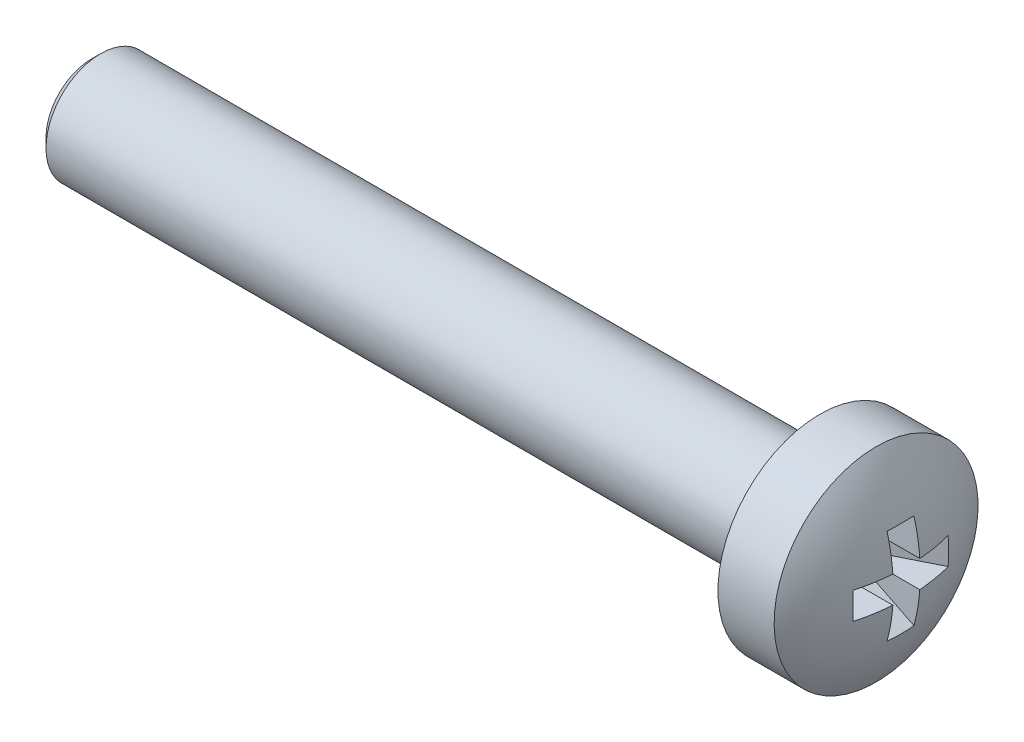
ISO-10303-21;
HEADER;
FILE_DESCRIPTION(('STEP AP214'),'2;1');
FILE_NAME('part.step','',(''),(''),'','','');
FILE_SCHEMA(('AUTOMOTIVE_DESIGN { 1 0 10303 214 1 1 1 1 }'));
ENDSEC;
DATA;
#1=APPLICATION_CONTEXT('core data for automotive mechanical design processes');
#2=APPLICATION_PROTOCOL_DEFINITION('international standard','automotive_design',2000,#1);
#3=PRODUCT_CONTEXT('',#1,'mechanical');
#4=PRODUCT('Part','Part','',(#3));
#5=PRODUCT_RELATED_PRODUCT_CATEGORY('part','',(#4));
#6=PRODUCT_DEFINITION_FORMATION('','',#4);
#7=PRODUCT_DEFINITION_CONTEXT('part definition',#1,'design');
#8=PRODUCT_DEFINITION('design','',#6,#7);
#9=PRODUCT_DEFINITION_SHAPE('','',#8);
#10=(LENGTH_UNIT() NAMED_UNIT(*) SI_UNIT(.MILLI.,.METRE.));
#11=(NAMED_UNIT(*) PLANE_ANGLE_UNIT() SI_UNIT($,.RADIAN.));
#12=(NAMED_UNIT(*) SI_UNIT($,.STERADIAN.) SOLID_ANGLE_UNIT());
#13=UNCERTAINTY_MEASURE_WITH_UNIT(LENGTH_MEASURE(1.E-05),#10,'distance_accuracy_value','');
#14=(GEOMETRIC_REPRESENTATION_CONTEXT(3) GLOBAL_UNCERTAINTY_ASSIGNED_CONTEXT((#13)) GLOBAL_UNIT_ASSIGNED_CONTEXT((#10,
#11,#12)) REPRESENTATION_CONTEXT('',''));
#15=CARTESIAN_POINT('',(0.,0.,0.));
#16=DIRECTION('',(0.,0.,1.));
#17=DIRECTION('',(1.,0.,0.));
#18=AXIS2_PLACEMENT_3D('',#15,#16,#17);
#19=CARTESIAN_POINT('',(-5.,0.,0.));
#20=DIRECTION('',(1.,0.,0.));
#21=DIRECTION('',(0.,-1.,0.));
#22=AXIS2_PLACEMENT_3D('',#19,#20,#21);
#23=SPHERICAL_SURFACE('',#22,5.);
#24=CARTESIAN_POINT('',(-4.56358241491322,0.,-0.875318258911803));
#25=DIRECTION('',(0.446197813109809,0.,-0.894934361602025));
#26=DIRECTION('',(-0.894934361602025,0.,-0.446197813109809));
#27=AXIS2_PLACEMENT_3D('',#24,#25,#26);
#28=CIRCLE('',#27,4.90340265907692);
#29=CARTESIAN_POINT('',(-0.187869730483241,0.37,1.3063316076711));
#30=VERTEX_POINT('',#29);
#31=CARTESIAN_POINT('',(-0.187869730483241,-0.37,1.3063316076711));
#32=VERTEX_POINT('',#31);
#33=EDGE_CURVE('E195',#30,#32,#28,.T.);
#34=ORIENTED_EDGE('',*,*,#33,.F.);
#35=CARTESIAN_POINT('',(-5.,0.37,0.));
#36=DIRECTION('',(0.,-1.,0.));
#37=DIRECTION('',(0.,0.,-1.));
#38=AXIS2_PLACEMENT_3D('',#35,#36,#37);
#39=CIRCLE('',#38,4.98629120689917);
#40=CARTESIAN_POINT('',(-0.0274553797879303,0.37,0.37));
#41=VERTEX_POINT('',#40);
#42=EDGE_CURVE('E114',#30,#41,#39,.F.);
#43=ORIENTED_EDGE('',*,*,#42,.T.);
#44=CARTESIAN_POINT('',(-5.,0.,0.37));
#45=DIRECTION('',(0.,0.,1.));
#46=DIRECTION('',(0.,-1.,0.));
#47=AXIS2_PLACEMENT_3D('',#44,#45,#46);
#48=CIRCLE('',#47,4.98629120689917);
#49=CARTESIAN_POINT('',(-0.187869730483241,1.3063316076711,0.37));
#50=VERTEX_POINT('',#49);
#51=EDGE_CURVE('E146',#50,#41,#48,.F.);
#52=ORIENTED_EDGE('',*,*,#51,.F.);
#53=CARTESIAN_POINT('',(-4.56358241491322,-0.875318258911803,0.));
#54=DIRECTION('',(0.446197813109809,-0.894934361602025,0.));
#55=DIRECTION('',(0.894934361602025,0.446197813109809,0.));
#56=AXIS2_PLACEMENT_3D('',#53,#54,#55);
#57=CIRCLE('',#56,4.90340265907692);
#58=CARTESIAN_POINT('',(-0.187869730483241,1.3063316076711,-0.37));
#59=VERTEX_POINT('',#58);
#60=EDGE_CURVE('E143',#50,#59,#57,.F.);
#61=ORIENTED_EDGE('',*,*,#60,.T.);
#62=CARTESIAN_POINT('',(-5.,0.,-0.37));
#63=DIRECTION('',(0.,0.,1.));
#64=DIRECTION('',(0.,-1.,0.));
#65=AXIS2_PLACEMENT_3D('',#62,#63,#64);
#66=CIRCLE('',#65,4.98629120689917);
#67=CARTESIAN_POINT('',(-0.0274553797879303,0.37,-0.37));
#68=VERTEX_POINT('',#67);
#69=EDGE_CURVE('E147',#59,#68,#66,.F.);
#70=ORIENTED_EDGE('',*,*,#69,.T.);
#71=CARTESIAN_POINT('',(-5.,0.37,0.));
#72=DIRECTION('',(0.,-1.,0.));
#73=DIRECTION('',(0.,0.,-1.));
#74=AXIS2_PLACEMENT_3D('',#71,#72,#73);
#75=CIRCLE('',#74,4.98629120689917);
#76=CARTESIAN_POINT('',(-0.187869730483241,0.37,-1.3063316076711));
#77=VERTEX_POINT('',#76);
#78=EDGE_CURVE('E197',#68,#77,#75,.F.);
#79=ORIENTED_EDGE('',*,*,#78,.T.);
#80=CARTESIAN_POINT('',(-4.56358241491322,0.,0.875318258911803));
#81=DIRECTION('',(0.446197813109809,0.,0.894934361602025));
#82=DIRECTION('',(0.894934361602025,0.,-0.446197813109809));
#83=AXIS2_PLACEMENT_3D('',#80,#81,#82);
#84=CIRCLE('',#83,4.90340265907692);
#85=CARTESIAN_POINT('',(-0.187869730483241,-0.37,-1.3063316076711));
#86=VERTEX_POINT('',#85);
#87=EDGE_CURVE('E200',#77,#86,#84,.F.);
#88=ORIENTED_EDGE('',*,*,#87,.T.);
#89=CARTESIAN_POINT('',(-5.,-0.37,0.));
#90=DIRECTION('',(0.,-1.,0.));
#91=DIRECTION('',(0.,0.,-1.));
#92=AXIS2_PLACEMENT_3D('',#89,#90,#91);
#93=CIRCLE('',#92,4.98629120689917);
#94=CARTESIAN_POINT('',(-0.0274553797879303,-0.37,-0.37));
#95=VERTEX_POINT('',#94);
#96=EDGE_CURVE('E201',#95,#86,#93,.F.);
#97=ORIENTED_EDGE('',*,*,#96,.F.);
#98=CARTESIAN_POINT('',(-5.,0.,-0.37));
#99=DIRECTION('',(0.,0.,1.));
#100=DIRECTION('',(0.,-1.,0.));
#101=AXIS2_PLACEMENT_3D('',#98,#99,#100);
#102=CIRCLE('',#101,4.98629120689917);
#103=CARTESIAN_POINT('',(-0.187869730483241,-1.3063316076711,-0.37));
#104=VERTEX_POINT('',#103);
#105=EDGE_CURVE('E157',#95,#104,#102,.F.);
#106=ORIENTED_EDGE('',*,*,#105,.T.);
#107=CARTESIAN_POINT('',(-4.56358241491322,0.875318258911802,0.));
#108=DIRECTION('',(0.446197813109809,0.894934361602025,0.));
#109=DIRECTION('',(-0.894934361602025,0.446197813109809,0.));
#110=AXIS2_PLACEMENT_3D('',#107,#108,#109);
#111=CIRCLE('',#110,4.90340265907692);
#112=CARTESIAN_POINT('',(-0.187869730483241,-1.3063316076711,0.37));
#113=VERTEX_POINT('',#112);
#114=EDGE_CURVE('E154',#113,#104,#111,.T.);
#115=ORIENTED_EDGE('',*,*,#114,.F.);
#116=CARTESIAN_POINT('',(-5.,0.,0.37));
#117=DIRECTION('',(0.,0.,1.));
#118=DIRECTION('',(0.,-1.,0.));
#119=AXIS2_PLACEMENT_3D('',#116,#117,#118);
#120=CIRCLE('',#119,4.98629120689917);
#121=CARTESIAN_POINT('',(-0.0274553797879303,-0.37,0.37));
#122=VERTEX_POINT('',#121);
#123=EDGE_CURVE('E158',#122,#113,#120,.F.);
#124=ORIENTED_EDGE('',*,*,#123,.F.);
#125=CARTESIAN_POINT('',(-5.,-0.37,0.));
#126=DIRECTION('',(0.,-1.,0.));
#127=DIRECTION('',(0.,0.,-1.));
#128=AXIS2_PLACEMENT_3D('',#125,#126,#127);
#129=CIRCLE('',#128,4.98629120689917);
#130=EDGE_CURVE('E193',#32,#122,#129,.F.);
#131=ORIENTED_EDGE('',*,*,#130,.F.);
#132=EDGE_LOOP('',(#34,#43,#52,#61,#70,#79,#88,#97,#106,#115,#124,#131));
#133=FACE_BOUND('',#132,.T.);
#134=CARTESIAN_POINT('',(-0.857536964558404,0.,0.));
#135=DIRECTION('',(1.,0.,0.));
#136=DIRECTION('',(0.,1.,0.));
#137=AXIS2_PLACEMENT_3D('',#134,#135,#136);
#138=CIRCLE('',#137,2.8);
#139=CARTESIAN_POINT('',(-0.857536964558404,2.8,0.));
#140=VERTEX_POINT('',#139);
#141=EDGE_CURVE('E118',#140,#140,#138,.T.);
#142=ORIENTED_EDGE('',*,*,#141,.T.);
#143=EDGE_LOOP('',(#142));
#144=FACE_BOUND('',#143,.T.);
#145=ADVANCED_FACE('F16',(#133,#144),#23,.T.);
#146=CARTESIAN_POINT('',(-22.4,0.,0.));
#147=DIRECTION('',(-1.,0.,0.));
#148=DIRECTION('',(0.,-1.,0.));
#149=AXIS2_PLACEMENT_3D('',#146,#147,#148);
#150=PLANE('',#149);
#151=CARTESIAN_POINT('',(-22.4,0.,0.));
#152=DIRECTION('',(-1.,0.,0.));
#153=DIRECTION('',(0.,-1.,0.));
#154=AXIS2_PLACEMENT_3D('',#151,#152,#153);
#155=CIRCLE('',#154,1.25);
#156=CARTESIAN_POINT('',(-22.4,-1.25,0.));
#157=VERTEX_POINT('',#156);
#158=EDGE_CURVE('E10',#157,#157,#155,.T.);
#159=ORIENTED_EDGE('',*,*,#158,.T.);
#160=EDGE_LOOP('',(#159));
#161=FACE_BOUND('',#160,.T.);
#162=ADVANCED_FACE('F262',(#161),#150,.T.);
#163=CARTESIAN_POINT('',(0.,0.,0.));
#164=DIRECTION('',(1.,0.,0.));
#165=DIRECTION('',(0.,1.,0.));
#166=AXIS2_PLACEMENT_3D('',#163,#164,#165);
#167=CYLINDRICAL_SURFACE('',#166,1.5);
#168=CARTESIAN_POINT('',(-22.15,0.,0.));
#169=DIRECTION('',(-1.,0.,0.));
#170=DIRECTION('',(0.,-1.,0.));
#171=AXIS2_PLACEMENT_3D('',#168,#169,#170);
#172=CIRCLE('',#171,1.5);
#173=CARTESIAN_POINT('',(-22.15,-1.5,0.));
#174=VERTEX_POINT('',#173);
#175=EDGE_CURVE('E26',#174,#174,#172,.F.);
#176=ORIENTED_EDGE('',*,*,#175,.T.);
#177=EDGE_LOOP('',(#176));
#178=FACE_BOUND('',#177,.T.);
#179=CARTESIAN_POINT('',(-2.4,0.,0.));
#180=DIRECTION('',(1.,0.,0.));
#181=DIRECTION('',(0.,1.,0.));
#182=AXIS2_PLACEMENT_3D('',#179,#180,#181);
#183=CIRCLE('',#182,1.5);
#184=CARTESIAN_POINT('',(-2.4,1.5,0.));
#185=VERTEX_POINT('',#184);
#186=EDGE_CURVE('E190',#185,#185,#183,.T.);
#187=ORIENTED_EDGE('',*,*,#186,.F.);
#188=EDGE_LOOP('',(#187));
#189=FACE_BOUND('',#188,.T.);
#190=ADVANCED_FACE('F268',(#178,#189),#167,.T.);
#191=CARTESIAN_POINT('',(-2.4,1.5,0.));
#192=DIRECTION('',(-1.,0.,0.));
#193=DIRECTION('',(0.,-1.,0.));
#194=AXIS2_PLACEMENT_3D('',#191,#192,#193);
#195=PLANE('',#194);
#196=ORIENTED_EDGE('',*,*,#186,.T.);
#197=EDGE_LOOP('',(#196));
#198=FACE_BOUND('',#197,.T.);
#199=CARTESIAN_POINT('',(-2.4,0.,0.));
#200=DIRECTION('',(1.,0.,0.));
#201=DIRECTION('',(0.,1.,0.));
#202=AXIS2_PLACEMENT_3D('',#199,#200,#201);
#203=CIRCLE('',#202,2.8);
#204=CARTESIAN_POINT('',(-2.4,2.8,0.));
#205=VERTEX_POINT('',#204);
#206=EDGE_CURVE('E187',#205,#205,#203,.T.);
#207=ORIENTED_EDGE('',*,*,#206,.F.);
#208=EDGE_LOOP('',(#207));
#209=FACE_BOUND('',#208,.T.);
#210=ADVANCED_FACE('F299',(#198,#209),#195,.T.);
#211=CARTESIAN_POINT('',(0.,0.,0.));
#212=DIRECTION('',(1.,0.,0.));
#213=DIRECTION('',(0.,1.,0.));
#214=AXIS2_PLACEMENT_3D('',#211,#212,#213);
#215=CYLINDRICAL_SURFACE('',#214,2.8);
#216=ORIENTED_EDGE('',*,*,#206,.T.);
#217=EDGE_LOOP('',(#216));
#218=FACE_BOUND('',#217,.T.);
#219=ORIENTED_EDGE('',*,*,#141,.F.);
#220=EDGE_LOOP('',(#219));
#221=FACE_BOUND('',#220,.T.);
#222=ADVANCED_FACE('F296',(#218,#221),#215,.T.);
#223=CARTESIAN_POINT('',(0.,0.,1.4));
#224=DIRECTION('',(0.446197813109809,0.,-0.894934361602025));
#225=DIRECTION('',(-0.894934361602025,0.,-0.446197813109809));
#226=AXIS2_PLACEMENT_3D('',#223,#224,#225);
#227=PLANE('',#226);
#228=ORIENTED_EDGE('',*,*,#33,.T.);
#229=DIRECTION('',(-0.894934361602025,0.,-0.446197813109809));
#230=VECTOR('',#229,1.);
#231=CARTESIAN_POINT('',(0.,-0.37,1.4));
#232=LINE('',#231,#230);
#233=CARTESIAN_POINT('',(-1.75,-0.37,0.527482185906493));
#234=VERTEX_POINT('',#233);
#235=EDGE_CURVE('E35',#234,#32,#232,.F.);
#236=ORIENTED_EDGE('',*,*,#235,.F.);
#237=DIRECTION('',(0.,1.,0.));
#238=VECTOR('',#237,1.);
#239=CARTESIAN_POINT('',(-1.75,0.,0.527482185906493));
#240=LINE('',#239,#238);
#241=CARTESIAN_POINT('',(-1.75,0.37,0.527482185906493));
#242=VERTEX_POINT('',#241);
#243=EDGE_CURVE('E126',#242,#234,#240,.F.);
#244=ORIENTED_EDGE('',*,*,#243,.F.);
#245=DIRECTION('',(-0.894934361602025,0.,-0.446197813109809));
#246=VECTOR('',#245,1.);
#247=CARTESIAN_POINT('',(0.,0.37,1.4));
#248=LINE('',#247,#246);
#249=EDGE_CURVE('E107',#242,#30,#248,.F.);
#250=ORIENTED_EDGE('',*,*,#249,.T.);
#251=EDGE_LOOP('',(#228,#236,#244,#250));
#252=FACE_BOUND('',#251,.T.);
#253=ADVANCED_FACE('F18',(#252),#227,.T.);
#254=CARTESIAN_POINT('',(-1.75,0.37,0.));
#255=DIRECTION('',(0.,-1.,0.));
#256=DIRECTION('',(0.,0.,-1.));
#257=AXIS2_PLACEMENT_3D('',#254,#255,#256);
#258=PLANE('',#257);
#259=ORIENTED_EDGE('',*,*,#249,.F.);
#260=DIRECTION('',(0.,0.,-1.));
#261=VECTOR('',#260,1.);
#262=CARTESIAN_POINT('',(-1.75,0.37,0.));
#263=LINE('',#262,#261);
#264=CARTESIAN_POINT('',(-1.75,0.37,0.37));
#265=VERTEX_POINT('',#264);
#266=EDGE_CURVE('E111',#242,#265,#263,.T.);
#267=ORIENTED_EDGE('',*,*,#266,.T.);
#268=DIRECTION('',(1.,0.,0.));
#269=VECTOR('',#268,1.);
#270=CARTESIAN_POINT('',(-1.75,0.37,0.37));
#271=LINE('',#270,#269);
#272=EDGE_CURVE('E119',#265,#41,#271,.T.);
#273=ORIENTED_EDGE('',*,*,#272,.T.);
#274=ORIENTED_EDGE('',*,*,#42,.F.);
#275=EDGE_LOOP('',(#259,#267,#273,#274));
#276=FACE_BOUND('',#275,.T.);
#277=ADVANCED_FACE('F109',(#276),#258,.T.);
#278=CARTESIAN_POINT('',(-1.75,0.,0.37));
#279=DIRECTION('',(0.,0.,1.));
#280=DIRECTION('',(0.,-1.,0.));
#281=AXIS2_PLACEMENT_3D('',#278,#279,#280);
#282=PLANE('',#281);
#283=ORIENTED_EDGE('',*,*,#51,.T.);
#284=ORIENTED_EDGE('',*,*,#272,.F.);
#285=DIRECTION('',(0.,-1.,0.));
#286=VECTOR('',#285,1.);
#287=CARTESIAN_POINT('',(-1.75,0.,0.37));
#288=LINE('',#287,#286);
#289=CARTESIAN_POINT('',(-1.75,0.527482185906492,0.37));
#290=VERTEX_POINT('',#289);
#291=EDGE_CURVE('E129',#290,#265,#288,.T.);
#292=ORIENTED_EDGE('',*,*,#291,.F.);
#293=DIRECTION('',(0.894934361602025,0.446197813109809,0.));
#294=VECTOR('',#293,1.);
#295=CARTESIAN_POINT('',(-1.96063300229114,0.42246444491505,0.37));
#296=LINE('',#295,#294);
#297=EDGE_CURVE('E139',#290,#50,#296,.T.);
#298=ORIENTED_EDGE('',*,*,#297,.T.);
#299=EDGE_LOOP('',(#283,#284,#292,#298));
#300=FACE_BOUND('',#299,.T.);
#301=ADVANCED_FACE('F250',(#300),#282,.F.);
#302=CARTESIAN_POINT('',(0.,1.4,0.));
#303=DIRECTION('',(0.446197813109809,-0.894934361602025,0.));
#304=DIRECTION('',(0.894934361602025,0.446197813109809,0.));
#305=AXIS2_PLACEMENT_3D('',#302,#303,#304);
#306=PLANE('',#305);
#307=ORIENTED_EDGE('',*,*,#297,.F.);
#308=DIRECTION('',(0.,0.,-1.));
#309=VECTOR('',#308,1.);
#310=CARTESIAN_POINT('',(-1.75,0.527482185906492,0.));
#311=LINE('',#310,#309);
#312=CARTESIAN_POINT('',(-1.75,0.527482185906492,-0.37));
#313=VERTEX_POINT('',#312);
#314=EDGE_CURVE('E151',#290,#313,#311,.T.);
#315=ORIENTED_EDGE('',*,*,#314,.T.);
#316=DIRECTION('',(0.894934361602025,0.446197813109809,0.));
#317=VECTOR('',#316,1.);
#318=CARTESIAN_POINT('',(-1.96063300229114,0.42246444491505,-0.37));
#319=LINE('',#318,#317);
#320=EDGE_CURVE('E142',#313,#59,#319,.T.);
#321=ORIENTED_EDGE('',*,*,#320,.T.);
#322=ORIENTED_EDGE('',*,*,#60,.F.);
#323=EDGE_LOOP('',(#307,#315,#321,#322));
#324=FACE_BOUND('',#323,.T.);
#325=ADVANCED_FACE('F248',(#324),#306,.T.);
#326=CARTESIAN_POINT('',(-1.75,0.,-0.37));
#327=DIRECTION('',(0.,0.,1.));
#328=DIRECTION('',(0.,-1.,0.));
#329=AXIS2_PLACEMENT_3D('',#326,#327,#328);
#330=PLANE('',#329);
#331=ORIENTED_EDGE('',*,*,#320,.F.);
#332=DIRECTION('',(0.,-1.,0.));
#333=VECTOR('',#332,1.);
#334=CARTESIAN_POINT('',(-1.75,0.,-0.37));
#335=LINE('',#334,#333);
#336=CARTESIAN_POINT('',(-1.75,0.37,-0.37));
#337=VERTEX_POINT('',#336);
#338=EDGE_CURVE('E153',#313,#337,#335,.T.);
#339=ORIENTED_EDGE('',*,*,#338,.T.);
#340=DIRECTION('',(1.,0.,0.));
#341=VECTOR('',#340,1.);
#342=CARTESIAN_POINT('',(-1.75,0.37,-0.37));
#343=LINE('',#342,#341);
#344=EDGE_CURVE('E150',#337,#68,#343,.T.);
#345=ORIENTED_EDGE('',*,*,#344,.T.);
#346=ORIENTED_EDGE('',*,*,#69,.F.);
#347=EDGE_LOOP('',(#331,#339,#345,#346));
#348=FACE_BOUND('',#347,.T.);
#349=ADVANCED_FACE('F245',(#348),#330,.T.);
#350=CARTESIAN_POINT('',(-1.75,0.37,0.));
#351=DIRECTION('',(0.,-1.,0.));
#352=DIRECTION('',(0.,0.,-1.));
#353=AXIS2_PLACEMENT_3D('',#350,#351,#352);
#354=PLANE('',#353);
#355=ORIENTED_EDGE('',*,*,#344,.F.);
#356=DIRECTION('',(0.,0.,-1.));
#357=VECTOR('',#356,1.);
#358=CARTESIAN_POINT('',(-1.75,0.37,0.));
#359=LINE('',#358,#357);
#360=CARTESIAN_POINT('',(-1.75,0.37,-0.527482185906493));
#361=VERTEX_POINT('',#360);
#362=EDGE_CURVE('E173',#337,#361,#359,.T.);
#363=ORIENTED_EDGE('',*,*,#362,.T.);
#364=DIRECTION('',(0.894934361602025,0.,-0.446197813109809));
#365=VECTOR('',#364,1.);
#366=CARTESIAN_POINT('',(0.,0.37,-1.4));
#367=LINE('',#366,#365);
#368=EDGE_CURVE('E180',#361,#77,#367,.T.);
#369=ORIENTED_EDGE('',*,*,#368,.T.);
#370=ORIENTED_EDGE('',*,*,#78,.F.);
#371=EDGE_LOOP('',(#355,#363,#369,#370));
#372=FACE_BOUND('',#371,.T.);
#373=ADVANCED_FACE('F242',(#372),#354,.T.);
#374=CARTESIAN_POINT('',(0.,0.,-1.4));
#375=DIRECTION('',(0.446197813109809,0.,0.894934361602025));
#376=DIRECTION('',(0.894934361602025,0.,-0.446197813109809));
#377=AXIS2_PLACEMENT_3D('',#374,#375,#376);
#378=PLANE('',#377);
#379=ORIENTED_EDGE('',*,*,#368,.F.);
#380=DIRECTION('',(0.,-1.,0.));
#381=VECTOR('',#380,1.);
#382=CARTESIAN_POINT('',(-1.75,0.,-0.527482185906493));
#383=LINE('',#382,#381);
#384=CARTESIAN_POINT('',(-1.75,-0.37,-0.527482185906493));
#385=VERTEX_POINT('',#384);
#386=EDGE_CURVE('E172',#361,#385,#383,.T.);
#387=ORIENTED_EDGE('',*,*,#386,.T.);
#388=DIRECTION('',(0.894934361602025,0.,-0.446197813109809));
#389=VECTOR('',#388,1.);
#390=CARTESIAN_POINT('',(0.,-0.37,-1.4));
#391=LINE('',#390,#389);
#392=EDGE_CURVE('E182',#385,#86,#391,.T.);
#393=ORIENTED_EDGE('',*,*,#392,.T.);
#394=ORIENTED_EDGE('',*,*,#87,.F.);
#395=EDGE_LOOP('',(#379,#387,#393,#394));
#396=FACE_BOUND('',#395,.T.);
#397=ADVANCED_FACE('F236',(#396),#378,.T.);
#398=CARTESIAN_POINT('',(-1.75,-0.37,0.));
#399=DIRECTION('',(0.,-1.,0.));
#400=DIRECTION('',(0.,0.,-1.));
#401=AXIS2_PLACEMENT_3D('',#398,#399,#400);
#402=PLANE('',#401);
#403=ORIENTED_EDGE('',*,*,#96,.T.);
#404=ORIENTED_EDGE('',*,*,#392,.F.);
#405=DIRECTION('',(0.,0.,-1.));
#406=VECTOR('',#405,1.);
#407=CARTESIAN_POINT('',(-1.75,-0.37,0.));
#408=LINE('',#407,#406);
#409=CARTESIAN_POINT('',(-1.75,-0.37,-0.37));
#410=VERTEX_POINT('',#409);
#411=EDGE_CURVE('E165',#410,#385,#408,.T.);
#412=ORIENTED_EDGE('',*,*,#411,.F.);
#413=DIRECTION('',(1.,0.,0.));
#414=VECTOR('',#413,1.);
#415=CARTESIAN_POINT('',(-1.75,-0.37,-0.37));
#416=LINE('',#415,#414);
#417=EDGE_CURVE('E79',#410,#95,#416,.T.);
#418=ORIENTED_EDGE('',*,*,#417,.T.);
#419=EDGE_LOOP('',(#403,#404,#412,#418));
#420=FACE_BOUND('',#419,.T.);
#421=ADVANCED_FACE('F232',(#420),#402,.F.);
#422=CARTESIAN_POINT('',(-1.75,0.,-0.37));
#423=DIRECTION('',(0.,0.,1.));
#424=DIRECTION('',(0.,-1.,0.));
#425=AXIS2_PLACEMENT_3D('',#422,#423,#424);
#426=PLANE('',#425);
#427=ORIENTED_EDGE('',*,*,#417,.F.);
#428=DIRECTION('',(0.,-1.,0.));
#429=VECTOR('',#428,1.);
#430=CARTESIAN_POINT('',(-1.75,0.,-0.37));
#431=LINE('',#430,#429);
#432=CARTESIAN_POINT('',(-1.75,-0.527482185906493,-0.37));
#433=VERTEX_POINT('',#432);
#434=EDGE_CURVE('E73',#410,#433,#431,.T.);
#435=ORIENTED_EDGE('',*,*,#434,.T.);
#436=DIRECTION('',(-0.894934361602025,0.446197813109809,0.));
#437=VECTOR('',#436,1.);
#438=CARTESIAN_POINT('',(-1.96063300229114,-0.42246444491505,-0.37));
#439=LINE('',#438,#437);
#440=EDGE_CURVE('E20',#433,#104,#439,.F.);
#441=ORIENTED_EDGE('',*,*,#440,.T.);
#442=ORIENTED_EDGE('',*,*,#105,.F.);
#443=EDGE_LOOP('',(#427,#435,#441,#442));
#444=FACE_BOUND('',#443,.T.);
#445=ADVANCED_FACE('F228',(#444),#426,.T.);
#446=CARTESIAN_POINT('',(0.,-1.4,0.));
#447=DIRECTION('',(0.446197813109809,0.894934361602025,0.));
#448=DIRECTION('',(-0.894934361602025,0.446197813109809,0.));
#449=AXIS2_PLACEMENT_3D('',#446,#447,#448);
#450=PLANE('',#449);
#451=ORIENTED_EDGE('',*,*,#114,.T.);
#452=ORIENTED_EDGE('',*,*,#440,.F.);
#453=DIRECTION('',(0.,0.,1.));
#454=VECTOR('',#453,1.);
#455=CARTESIAN_POINT('',(-1.75,-0.527482185906493,0.));
#456=LINE('',#455,#454);
#457=CARTESIAN_POINT('',(-1.75,-0.527482185906493,0.37));
#458=VERTEX_POINT('',#457);
#459=EDGE_CURVE('E161',#458,#433,#456,.F.);
#460=ORIENTED_EDGE('',*,*,#459,.F.);
#461=DIRECTION('',(-0.894934361602025,0.446197813109809,0.));
#462=VECTOR('',#461,1.);
#463=CARTESIAN_POINT('',(-1.96063300229114,-0.42246444491505,0.37));
#464=LINE('',#463,#462);
#465=EDGE_CURVE('E159',#458,#113,#464,.F.);
#466=ORIENTED_EDGE('',*,*,#465,.T.);
#467=EDGE_LOOP('',(#451,#452,#460,#466));
#468=FACE_BOUND('',#467,.T.);
#469=ADVANCED_FACE('F227',(#468),#450,.T.);
#470=CARTESIAN_POINT('',(-1.75,0.,0.37));
#471=DIRECTION('',(0.,0.,1.));
#472=DIRECTION('',(0.,-1.,0.));
#473=AXIS2_PLACEMENT_3D('',#470,#471,#472);
#474=PLANE('',#473);
#475=ORIENTED_EDGE('',*,*,#123,.T.);
#476=ORIENTED_EDGE('',*,*,#465,.F.);
#477=DIRECTION('',(0.,-1.,0.));
#478=VECTOR('',#477,1.);
#479=CARTESIAN_POINT('',(-1.75,0.,0.37));
#480=LINE('',#479,#478);
#481=CARTESIAN_POINT('',(-1.75,-0.37,0.37));
#482=VERTEX_POINT('',#481);
#483=EDGE_CURVE('E133',#482,#458,#480,.T.);
#484=ORIENTED_EDGE('',*,*,#483,.F.);
#485=DIRECTION('',(1.,0.,0.));
#486=VECTOR('',#485,1.);
#487=CARTESIAN_POINT('',(-1.75,-0.37,0.37));
#488=LINE('',#487,#486);
#489=EDGE_CURVE('E138',#482,#122,#488,.T.);
#490=ORIENTED_EDGE('',*,*,#489,.T.);
#491=EDGE_LOOP('',(#475,#476,#484,#490));
#492=FACE_BOUND('',#491,.T.);
#493=ADVANCED_FACE('F225',(#492),#474,.F.);
#494=CARTESIAN_POINT('',(-1.75,-0.37,0.));
#495=DIRECTION('',(0.,-1.,0.));
#496=DIRECTION('',(0.,0.,-1.));
#497=AXIS2_PLACEMENT_3D('',#494,#495,#496);
#498=PLANE('',#497);
#499=ORIENTED_EDGE('',*,*,#130,.T.);
#500=ORIENTED_EDGE('',*,*,#489,.F.);
#501=DIRECTION('',(0.,0.,-1.));
#502=VECTOR('',#501,1.);
#503=CARTESIAN_POINT('',(-1.75,-0.37,0.));
#504=LINE('',#503,#502);
#505=EDGE_CURVE('E131',#234,#482,#504,.T.);
#506=ORIENTED_EDGE('',*,*,#505,.F.);
#507=ORIENTED_EDGE('',*,*,#235,.T.);
#508=EDGE_LOOP('',(#499,#500,#506,#507));
#509=FACE_BOUND('',#508,.T.);
#510=ADVANCED_FACE('F223',(#509),#498,.F.);
#511=CARTESIAN_POINT('',(-1.75,0.,0.));
#512=DIRECTION('',(1.,0.,0.));
#513=DIRECTION('',(0.,0.,-1.));
#514=AXIS2_PLACEMENT_3D('',#511,#512,#513);
#515=PLANE('',#514);
#516=ORIENTED_EDGE('',*,*,#243,.T.);
#517=ORIENTED_EDGE('',*,*,#505,.T.);
#518=ORIENTED_EDGE('',*,*,#483,.T.);
#519=ORIENTED_EDGE('',*,*,#459,.T.);
#520=ORIENTED_EDGE('',*,*,#434,.F.);
#521=ORIENTED_EDGE('',*,*,#411,.T.);
#522=ORIENTED_EDGE('',*,*,#386,.F.);
#523=ORIENTED_EDGE('',*,*,#362,.F.);
#524=ORIENTED_EDGE('',*,*,#338,.F.);
#525=ORIENTED_EDGE('',*,*,#314,.F.);
#526=ORIENTED_EDGE('',*,*,#291,.T.);
#527=ORIENTED_EDGE('',*,*,#266,.F.);
#528=EDGE_LOOP('',(#516,#517,#518,#519,#520,#521,#522,#523,#524,#525,#526,#527));
#529=FACE_BOUND('',#528,.T.);
#530=ADVANCED_FACE('F124',(#529),#515,.T.);
#531=CARTESIAN_POINT('',(-22.15,0.,0.));
#532=DIRECTION('',(1.,0.,0.));
#533=DIRECTION('',(0.,1.,0.));
#534=AXIS2_PLACEMENT_3D('',#531,#532,#533);
#535=CONICAL_SURFACE('',#534,1.5,0.785398163397448);
#536=ORIENTED_EDGE('',*,*,#158,.F.);
#537=EDGE_LOOP('',(#536));
#538=FACE_BOUND('',#537,.T.);
#539=ORIENTED_EDGE('',*,*,#175,.F.);
#540=EDGE_LOOP('',(#539));
#541=FACE_BOUND('',#540,.T.);
#542=ADVANCED_FACE('F273',(#538,#541),#535,.T.);
#543=CLOSED_SHELL('',(#145,#162,#190,#210,#222,#253,#277,#301,#325,#349,#373,#397,#421,#445,
#469,#493,#510,#530,#542));
#544=MANIFOLD_SOLID_BREP('B1',#543);
#545=ADVANCED_BREP_SHAPE_REPRESENTATION('',(#18,#544),#14);
#546=SHAPE_DEFINITION_REPRESENTATION(#9,#545);
ENDSEC;
END-ISO-10303-21;
